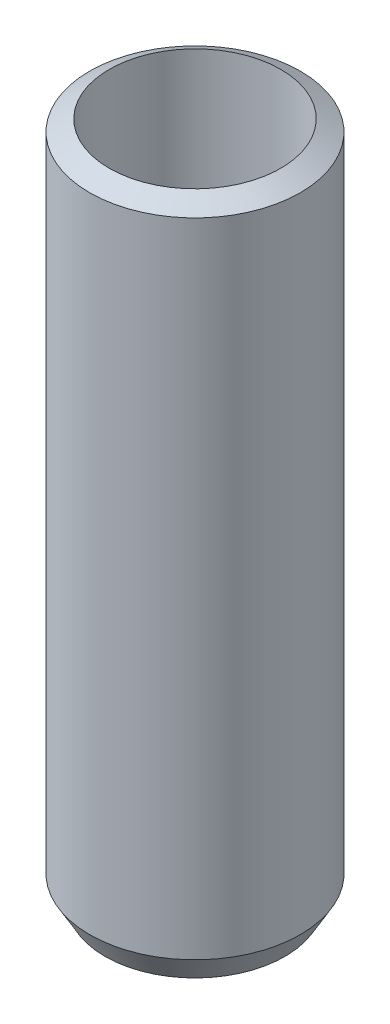
ISO-10303-21;
HEADER;
FILE_DESCRIPTION(('STEP AP214'),'2;1');
FILE_NAME('part.step','',(''),(''),'','','');
FILE_SCHEMA(('AUTOMOTIVE_DESIGN { 1 0 10303 214 1 1 1 1 }'));
ENDSEC;
DATA;
#1=APPLICATION_CONTEXT('core data for automotive mechanical design processes');
#2=APPLICATION_PROTOCOL_DEFINITION('international standard','automotive_design',2000,#1);
#3=PRODUCT_CONTEXT('',#1,'mechanical');
#4=PRODUCT('Part','Part','',(#3));
#5=PRODUCT_RELATED_PRODUCT_CATEGORY('part','',(#4));
#6=PRODUCT_DEFINITION_FORMATION('','',#4);
#7=PRODUCT_DEFINITION_CONTEXT('part definition',#1,'design');
#8=PRODUCT_DEFINITION('design','',#6,#7);
#9=PRODUCT_DEFINITION_SHAPE('','',#8);
#10=(LENGTH_UNIT() NAMED_UNIT(*) SI_UNIT(.MILLI.,.METRE.));
#11=(NAMED_UNIT(*) PLANE_ANGLE_UNIT() SI_UNIT($,.RADIAN.));
#12=(NAMED_UNIT(*) SI_UNIT($,.STERADIAN.) SOLID_ANGLE_UNIT());
#13=UNCERTAINTY_MEASURE_WITH_UNIT(LENGTH_MEASURE(1.E-05),#10,'distance_accuracy_value','');
#14=(GEOMETRIC_REPRESENTATION_CONTEXT(3) GLOBAL_UNCERTAINTY_ASSIGNED_CONTEXT((#13)) GLOBAL_UNIT_ASSIGNED_CONTEXT((#10,
#11,#12)) REPRESENTATION_CONTEXT('',''));
#15=CARTESIAN_POINT('',(0.,0.,0.));
#16=DIRECTION('',(0.,0.,1.));
#17=DIRECTION('',(1.,0.,0.));
#18=AXIS2_PLACEMENT_3D('',#15,#16,#17);
#19=CARTESIAN_POINT('',(0.,259.874091168853,0.));
#20=DIRECTION('',(0.,-1.,0.));
#21=DIRECTION('',(0.,0.,-1.));
#22=AXIS2_PLACEMENT_3D('',#19,#20,#21);
#23=CYLINDRICAL_SURFACE('',#22,40.);
#24=CARTESIAN_POINT('',(0.,254.047220221647,0.));
#25=DIRECTION('',(0.,1.,0.));
#26=DIRECTION('',(0.,0.,1.));
#27=AXIS2_PLACEMENT_3D('',#24,#25,#26);
#28=CIRCLE('',#27,40.);
#29=CARTESIAN_POINT('',(0.,254.047220221647,40.));
#30=VERTEX_POINT('',#29);
#31=EDGE_CURVE('E50',#30,#30,#28,.F.);
#32=ORIENTED_EDGE('',*,*,#31,.T.);
#33=EDGE_LOOP('',(#32));
#34=FACE_BOUND('',#33,.T.);
#35=CARTESIAN_POINT('',(0.,10.0924365297087,0.));
#36=DIRECTION('',(0.,1.,0.));
#37=DIRECTION('',(0.,0.,1.));
#38=AXIS2_PLACEMENT_3D('',#35,#36,#37);
#39=CIRCLE('',#38,40.);
#40=CARTESIAN_POINT('',(0.,10.0924365297087,40.));
#41=VERTEX_POINT('',#40);
#42=EDGE_CURVE('E51',#41,#41,#39,.T.);
#43=ORIENTED_EDGE('',*,*,#42,.T.);
#44=EDGE_LOOP('',(#43));
#45=FACE_BOUND('',#44,.T.);
#46=ADVANCED_FACE('F39',(#34,#45),#23,.T.);
#47=CARTESIAN_POINT('',(0.,0.,0.));
#48=DIRECTION('',(0.,1.,0.));
#49=DIRECTION('',(0.,0.,1.));
#50=AXIS2_PLACEMENT_3D('',#47,#48,#49);
#51=PLANE('',#50);
#52=CARTESIAN_POINT('',(0.,0.,0.));
#53=DIRECTION('',(0.,1.,0.));
#54=DIRECTION('',(0.,0.,1.));
#55=AXIS2_PLACEMENT_3D('',#52,#53,#54);
#56=CIRCLE('',#55,34.1731290527934);
#57=CARTESIAN_POINT('',(0.,0.,34.1731290527934));
#58=VERTEX_POINT('',#57);
#59=EDGE_CURVE('E10',#58,#58,#56,.F.);
#60=ORIENTED_EDGE('',*,*,#59,.T.);
#61=EDGE_LOOP('',(#60));
#62=FACE_BOUND('',#61,.T.);
#63=CARTESIAN_POINT('',(0.,0.,0.));
#64=DIRECTION('',(0.,1.,0.));
#65=DIRECTION('',(0.,0.,1.));
#66=AXIS2_PLACEMENT_3D('',#63,#64,#65);
#67=CIRCLE('',#66,32.5540974058283);
#68=CARTESIAN_POINT('',(0.,0.,32.5540974058283));
#69=VERTEX_POINT('',#68);
#70=EDGE_CURVE('E58',#69,#69,#67,.T.);
#71=ORIENTED_EDGE('',*,*,#70,.T.);
#72=EDGE_LOOP('',(#71));
#73=FACE_BOUND('',#72,.T.);
#74=ADVANCED_FACE('F62',(#62,#73),#51,.F.);
#75=CARTESIAN_POINT('',(0.,259.874091168853,0.));
#76=DIRECTION('',(0.,-1.,0.));
#77=DIRECTION('',(0.,0.,-1.));
#78=AXIS2_PLACEMENT_3D('',#75,#76,#77);
#79=CYLINDRICAL_SURFACE('',#78,32.5540974058283);
#80=CARTESIAN_POINT('',(0.,258.346114088751,0.));
#81=DIRECTION('',(0.,-1.,0.));
#82=DIRECTION('',(0.,0.,-1.));
#83=AXIS2_PLACEMENT_3D('',#80,#81,#82);
#84=CIRCLE('',#83,32.5540974058283);
#85=CARTESIAN_POINT('',(0.,258.346114088751,-32.5540974058283));
#86=VERTEX_POINT('',#85);
#87=EDGE_CURVE('E54',#86,#86,#84,.F.);
#88=ORIENTED_EDGE('',*,*,#87,.T.);
#89=EDGE_LOOP('',(#88));
#90=FACE_BOUND('',#89,.T.);
#91=ORIENTED_EDGE('',*,*,#70,.F.);
#92=EDGE_LOOP('',(#91));
#93=FACE_BOUND('',#92,.T.);
#94=ADVANCED_FACE('F68',(#90,#93),#79,.F.);
#95=CARTESIAN_POINT('',(0.,259.874091168853,0.));
#96=DIRECTION('',(0.,-1.,0.));
#97=DIRECTION('',(0.,0.,-1.));
#98=AXIS2_PLACEMENT_3D('',#95,#96,#97);
#99=CONICAL_SURFACE('',#98,29.9075634702911,1.0471975511966);
#100=ORIENTED_EDGE('',*,*,#31,.F.);
#101=EDGE_LOOP('',(#100));
#102=FACE_BOUND('',#101,.T.);
#103=ORIENTED_EDGE('',*,*,#87,.F.);
#104=EDGE_LOOP('',(#103));
#105=FACE_BOUND('',#104,.T.);
#106=ADVANCED_FACE('F66',(#102,#105),#99,.T.);
#107=CARTESIAN_POINT('',(0.,10.0924365297087,0.));
#108=DIRECTION('',(0.,1.,0.));
#109=DIRECTION('',(0.,0.,1.));
#110=AXIS2_PLACEMENT_3D('',#107,#108,#109);
#111=CONICAL_SURFACE('',#110,40.,0.523598775598303);
#112=ORIENTED_EDGE('',*,*,#59,.F.);
#113=EDGE_LOOP('',(#112));
#114=FACE_BOUND('',#113,.T.);
#115=ORIENTED_EDGE('',*,*,#42,.F.);
#116=EDGE_LOOP('',(#115));
#117=FACE_BOUND('',#116,.T.);
#118=ADVANCED_FACE('F45',(#114,#117),#111,.T.);
#119=CLOSED_SHELL('',(#46,#74,#94,#106,#118));
#120=MANIFOLD_SOLID_BREP('B2',#119);
#121=ADVANCED_BREP_SHAPE_REPRESENTATION('',(#18,#120),#14);
#122=SHAPE_DEFINITION_REPRESENTATION(#9,#121);
ENDSEC;
END-ISO-10303-21;
